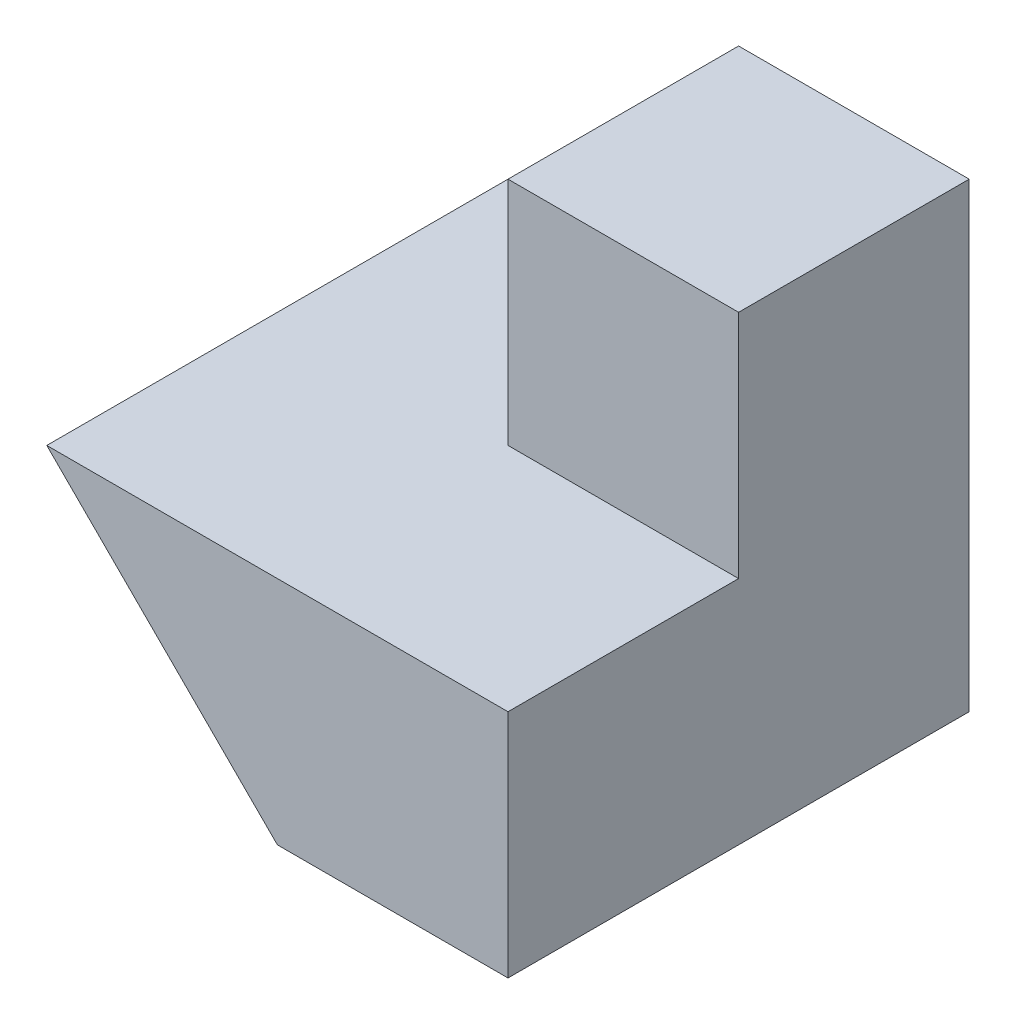
ISO-10303-21;
HEADER;
FILE_DESCRIPTION(('STEP AP214'),'2;1');
FILE_NAME('part.step','',(''),(''),'','','');
FILE_SCHEMA(('AUTOMOTIVE_DESIGN { 1 0 10303 214 1 1 1 1 }'));
ENDSEC;
DATA;
#1=APPLICATION_CONTEXT('core data for automotive mechanical design processes');
#2=APPLICATION_PROTOCOL_DEFINITION('international standard','automotive_design',2000,#1);
#3=PRODUCT_CONTEXT('',#1,'mechanical');
#4=PRODUCT('Part','Part','',(#3));
#5=PRODUCT_RELATED_PRODUCT_CATEGORY('part','',(#4));
#6=PRODUCT_DEFINITION_FORMATION('','',#4);
#7=PRODUCT_DEFINITION_CONTEXT('part definition',#1,'design');
#8=PRODUCT_DEFINITION('design','',#6,#7);
#9=PRODUCT_DEFINITION_SHAPE('','',#8);
#10=(LENGTH_UNIT() NAMED_UNIT(*) SI_UNIT(.MILLI.,.METRE.));
#11=(NAMED_UNIT(*) PLANE_ANGLE_UNIT() SI_UNIT($,.RADIAN.));
#12=(NAMED_UNIT(*) SI_UNIT($,.STERADIAN.) SOLID_ANGLE_UNIT());
#13=UNCERTAINTY_MEASURE_WITH_UNIT(LENGTH_MEASURE(1.E-05),#10,'distance_accuracy_value','');
#14=(GEOMETRIC_REPRESENTATION_CONTEXT(3) GLOBAL_UNCERTAINTY_ASSIGNED_CONTEXT((#13)) GLOBAL_UNIT_ASSIGNED_CONTEXT((#10,
#11,#12)) REPRESENTATION_CONTEXT('',''));
#15=CARTESIAN_POINT('',(0.,0.,0.));
#16=DIRECTION('',(0.,0.,1.));
#17=DIRECTION('',(1.,0.,0.));
#18=AXIS2_PLACEMENT_3D('',#15,#16,#17);
#19=CARTESIAN_POINT('',(0.,0.,40.));
#20=DIRECTION('',(1.,0.,0.));
#21=DIRECTION('',(0.,0.,-1.));
#22=AXIS2_PLACEMENT_3D('',#19,#20,#21);
#23=PLANE('',#22);
#24=DIRECTION('',(0.,-1.,0.));
#25=VECTOR('',#24,1.);
#26=CARTESIAN_POINT('',(0.,0.,20.));
#27=LINE('',#26,#25);
#28=CARTESIAN_POINT('',(0.,20.,20.));
#29=VERTEX_POINT('',#28);
#30=CARTESIAN_POINT('',(0.,0.,20.));
#31=VERTEX_POINT('',#30);
#32=EDGE_CURVE('E101',#29,#31,#27,.T.);
#33=ORIENTED_EDGE('',*,*,#32,.F.);
#34=DIRECTION('',(0.,0.,1.));
#35=VECTOR('',#34,1.);
#36=CARTESIAN_POINT('',(0.,20.,0.));
#37=LINE('',#36,#35);
#38=CARTESIAN_POINT('',(0.,20.,0.));
#39=VERTEX_POINT('',#38);
#40=EDGE_CURVE('E123',#39,#29,#37,.T.);
#41=ORIENTED_EDGE('',*,*,#40,.F.);
#42=DIRECTION('',(0.,-1.,0.));
#43=VECTOR('',#42,1.);
#44=CARTESIAN_POINT('',(0.,0.,0.));
#45=LINE('',#44,#43);
#46=CARTESIAN_POINT('',(0.,0.,0.));
#47=VERTEX_POINT('',#46);
#48=EDGE_CURVE('E121',#39,#47,#45,.T.);
#49=ORIENTED_EDGE('',*,*,#48,.T.);
#50=DIRECTION('',(0.,0.,-1.));
#51=VECTOR('',#50,1.);
#52=CARTESIAN_POINT('',(0.,0.,40.));
#53=LINE('',#52,#51);
#54=EDGE_CURVE('E11',#31,#47,#53,.T.);
#55=ORIENTED_EDGE('',*,*,#54,.F.);
#56=EDGE_LOOP('',(#33,#41,#49,#55));
#57=FACE_BOUND('',#56,.T.);
#58=ADVANCED_FACE('F33',(#57),#23,.F.);
#59=CARTESIAN_POINT('',(0.,0.,40.));
#60=DIRECTION('',(0.,1.,0.));
#61=DIRECTION('',(0.,0.,1.));
#62=AXIS2_PLACEMENT_3D('',#59,#60,#61);
#63=PLANE('',#62);
#64=DIRECTION('',(1.,0.,0.));
#65=VECTOR('',#64,1.);
#66=CARTESIAN_POINT('',(0.,0.,40.));
#67=LINE('',#66,#65);
#68=CARTESIAN_POINT('',(20.,0.,40.));
#69=VERTEX_POINT('',#68);
#70=CARTESIAN_POINT('',(40.,0.,40.));
#71=VERTEX_POINT('',#70);
#72=EDGE_CURVE('E143',#69,#71,#67,.T.);
#73=ORIENTED_EDGE('',*,*,#72,.F.);
#74=DIRECTION('',(0.,0.,1.));
#75=VECTOR('',#74,1.);
#76=CARTESIAN_POINT('',(20.,0.,20.));
#77=LINE('',#76,#75);
#78=CARTESIAN_POINT('',(20.,0.,20.));
#79=VERTEX_POINT('',#78);
#80=EDGE_CURVE('E118',#79,#69,#77,.T.);
#81=ORIENTED_EDGE('',*,*,#80,.F.);
#82=DIRECTION('',(1.,0.,0.));
#83=VECTOR('',#82,1.);
#84=CARTESIAN_POINT('',(20.,0.,20.));
#85=LINE('',#84,#83);
#86=EDGE_CURVE('E104',#31,#79,#85,.T.);
#87=ORIENTED_EDGE('',*,*,#86,.F.);
#88=ORIENTED_EDGE('',*,*,#54,.T.);
#89=DIRECTION('',(1.,0.,0.));
#90=VECTOR('',#89,1.);
#91=CARTESIAN_POINT('',(0.,0.,0.));
#92=LINE('',#91,#90);
#93=CARTESIAN_POINT('',(40.,0.,0.));
#94=VERTEX_POINT('',#93);
#95=EDGE_CURVE('E126',#47,#94,#92,.T.);
#96=ORIENTED_EDGE('',*,*,#95,.T.);
#97=DIRECTION('',(0.,0.,-1.));
#98=VECTOR('',#97,1.);
#99=CARTESIAN_POINT('',(40.,0.,40.));
#100=LINE('',#99,#98);
#101=EDGE_CURVE('E40',#71,#94,#100,.T.);
#102=ORIENTED_EDGE('',*,*,#101,.F.);
#103=EDGE_LOOP('',(#73,#81,#87,#88,#96,#102));
#104=FACE_BOUND('',#103,.T.);
#105=ADVANCED_FACE('F116',(#104),#63,.F.);
#106=CARTESIAN_POINT('',(40.,0.,40.));
#107=DIRECTION('',(-1.,0.,0.));
#108=DIRECTION('',(0.,0.,1.));
#109=AXIS2_PLACEMENT_3D('',#106,#107,#108);
#110=PLANE('',#109);
#111=DIRECTION('',(0.,-1.,0.));
#112=VECTOR('',#111,1.);
#113=CARTESIAN_POINT('',(40.,0.,20.));
#114=LINE('',#113,#112);
#115=CARTESIAN_POINT('',(40.,40.,20.));
#116=VERTEX_POINT('',#115);
#117=CARTESIAN_POINT('',(40.,20.,20.));
#118=VERTEX_POINT('',#117);
#119=EDGE_CURVE('E169',#116,#118,#114,.T.);
#120=ORIENTED_EDGE('',*,*,#119,.T.);
#121=DIRECTION('',(0.,0.,1.));
#122=VECTOR('',#121,1.);
#123=CARTESIAN_POINT('',(40.,20.,40.));
#124=LINE('',#123,#122);
#125=CARTESIAN_POINT('',(40.,20.,40.));
#126=VERTEX_POINT('',#125);
#127=EDGE_CURVE('E165',#118,#126,#124,.T.);
#128=ORIENTED_EDGE('',*,*,#127,.T.);
#129=DIRECTION('',(0.,1.,0.));
#130=VECTOR('',#129,1.);
#131=CARTESIAN_POINT('',(40.,0.,40.));
#132=LINE('',#131,#130);
#133=EDGE_CURVE('E145',#71,#126,#132,.T.);
#134=ORIENTED_EDGE('',*,*,#133,.F.);
#135=ORIENTED_EDGE('',*,*,#101,.T.);
#136=DIRECTION('',(0.,1.,0.));
#137=VECTOR('',#136,1.);
#138=CARTESIAN_POINT('',(40.,0.,0.));
#139=LINE('',#138,#137);
#140=CARTESIAN_POINT('',(40.,40.,0.));
#141=VERTEX_POINT('',#140);
#142=EDGE_CURVE('E133',#94,#141,#139,.T.);
#143=ORIENTED_EDGE('',*,*,#142,.T.);
#144=DIRECTION('',(0.,0.,-1.));
#145=VECTOR('',#144,1.);
#146=CARTESIAN_POINT('',(40.,40.,40.));
#147=LINE('',#146,#145);
#148=EDGE_CURVE('E144',#116,#141,#147,.T.);
#149=ORIENTED_EDGE('',*,*,#148,.F.);
#150=EDGE_LOOP('',(#120,#128,#134,#135,#143,#149));
#151=FACE_BOUND('',#150,.T.);
#152=ADVANCED_FACE('F149',(#151),#110,.F.);
#153=CARTESIAN_POINT('',(0.,40.,40.));
#154=DIRECTION('',(0.,-1.,0.));
#155=DIRECTION('',(0.,0.,-1.));
#156=AXIS2_PLACEMENT_3D('',#153,#154,#155);
#157=PLANE('',#156);
#158=DIRECTION('',(0.,0.,1.));
#159=VECTOR('',#158,1.);
#160=CARTESIAN_POINT('',(20.,40.,0.));
#161=LINE('',#160,#159);
#162=CARTESIAN_POINT('',(20.,40.,0.));
#163=VERTEX_POINT('',#162);
#164=CARTESIAN_POINT('',(20.,40.,20.));
#165=VERTEX_POINT('',#164);
#166=EDGE_CURVE('E127',#163,#165,#161,.T.);
#167=ORIENTED_EDGE('',*,*,#166,.T.);
#168=DIRECTION('',(-1.,0.,0.));
#169=VECTOR('',#168,1.);
#170=CARTESIAN_POINT('',(60.,40.,20.));
#171=LINE('',#170,#169);
#172=EDGE_CURVE('E172',#116,#165,#171,.T.);
#173=ORIENTED_EDGE('',*,*,#172,.F.);
#174=ORIENTED_EDGE('',*,*,#148,.T.);
#175=DIRECTION('',(-1.,0.,0.));
#176=VECTOR('',#175,1.);
#177=CARTESIAN_POINT('',(0.,40.,0.));
#178=LINE('',#177,#176);
#179=EDGE_CURVE('E137',#141,#163,#178,.T.);
#180=ORIENTED_EDGE('',*,*,#179,.T.);
#181=EDGE_LOOP('',(#167,#173,#174,#180));
#182=FACE_BOUND('',#181,.T.);
#183=ADVANCED_FACE('F188',(#182),#157,.F.);
#184=CARTESIAN_POINT('',(0.,0.,40.));
#185=DIRECTION('',(0.,0.,-1.));
#186=DIRECTION('',(-1.,0.,0.));
#187=AXIS2_PLACEMENT_3D('',#184,#185,#186);
#188=PLANE('',#187);
#189=DIRECTION('',(1.,0.,0.));
#190=VECTOR('',#189,1.);
#191=CARTESIAN_POINT('',(0.,20.,40.));
#192=LINE('',#191,#190);
#193=CARTESIAN_POINT('',(0.,20.,40.));
#194=VERTEX_POINT('',#193);
#195=EDGE_CURVE('E162',#194,#126,#192,.T.);
#196=ORIENTED_EDGE('',*,*,#195,.F.);
#197=DIRECTION('',(-0.707106781186547,0.707106781186548,0.));
#198=VECTOR('',#197,1.);
#199=CARTESIAN_POINT('',(0.,20.,40.));
#200=LINE('',#199,#198);
#201=EDGE_CURVE('E111',#69,#194,#200,.T.);
#202=ORIENTED_EDGE('',*,*,#201,.F.);
#203=ORIENTED_EDGE('',*,*,#72,.T.);
#204=ORIENTED_EDGE('',*,*,#133,.T.);
#205=EDGE_LOOP('',(#196,#202,#203,#204));
#206=FACE_BOUND('',#205,.T.);
#207=ADVANCED_FACE('F186',(#206),#188,.F.);
#208=CARTESIAN_POINT('',(0.,0.,0.));
#209=DIRECTION('',(0.,0.,-1.));
#210=DIRECTION('',(-1.,0.,0.));
#211=AXIS2_PLACEMENT_3D('',#208,#209,#210);
#212=PLANE('',#211);
#213=DIRECTION('',(0.,1.,0.));
#214=VECTOR('',#213,1.);
#215=CARTESIAN_POINT('',(20.,40.,0.));
#216=LINE('',#215,#214);
#217=CARTESIAN_POINT('',(20.,20.,0.));
#218=VERTEX_POINT('',#217);
#219=EDGE_CURVE('E55',#218,#163,#216,.T.);
#220=ORIENTED_EDGE('',*,*,#219,.T.);
#221=ORIENTED_EDGE('',*,*,#179,.F.);
#222=ORIENTED_EDGE('',*,*,#142,.F.);
#223=ORIENTED_EDGE('',*,*,#95,.F.);
#224=ORIENTED_EDGE('',*,*,#48,.F.);
#225=DIRECTION('',(1.,0.,0.));
#226=VECTOR('',#225,1.);
#227=CARTESIAN_POINT('',(0.,20.,0.));
#228=LINE('',#227,#226);
#229=EDGE_CURVE('E164',#39,#218,#228,.T.);
#230=ORIENTED_EDGE('',*,*,#229,.T.);
#231=EDGE_LOOP('',(#220,#221,#222,#223,#224,#230));
#232=FACE_BOUND('',#231,.T.);
#233=ADVANCED_FACE('F130',(#232),#212,.T.);
#234=CARTESIAN_POINT('',(20.,40.,0.));
#235=DIRECTION('',(1.,0.,0.));
#236=DIRECTION('',(0.,0.,-1.));
#237=AXIS2_PLACEMENT_3D('',#234,#235,#236);
#238=PLANE('',#237);
#239=DIRECTION('',(0.,0.,1.));
#240=VECTOR('',#239,1.);
#241=CARTESIAN_POINT('',(20.,20.,0.));
#242=LINE('',#241,#240);
#243=CARTESIAN_POINT('',(20.,20.,20.));
#244=VERTEX_POINT('',#243);
#245=EDGE_CURVE('E158',#218,#244,#242,.T.);
#246=ORIENTED_EDGE('',*,*,#245,.T.);
#247=DIRECTION('',(0.,-1.,0.));
#248=VECTOR('',#247,1.);
#249=CARTESIAN_POINT('',(20.,40.,20.));
#250=LINE('',#249,#248);
#251=EDGE_CURVE('E47',#165,#244,#250,.T.);
#252=ORIENTED_EDGE('',*,*,#251,.F.);
#253=ORIENTED_EDGE('',*,*,#166,.F.);
#254=ORIENTED_EDGE('',*,*,#219,.F.);
#255=EDGE_LOOP('',(#246,#252,#253,#254));
#256=FACE_BOUND('',#255,.T.);
#257=ADVANCED_FACE('F194',(#256),#238,.F.);
#258=CARTESIAN_POINT('',(0.,20.,0.));
#259=DIRECTION('',(0.,-1.,0.));
#260=DIRECTION('',(0.,0.,-1.));
#261=AXIS2_PLACEMENT_3D('',#258,#259,#260);
#262=PLANE('',#261);
#263=ORIENTED_EDGE('',*,*,#195,.T.);
#264=ORIENTED_EDGE('',*,*,#127,.F.);
#265=DIRECTION('',(-1.,0.,0.));
#266=VECTOR('',#265,1.);
#267=CARTESIAN_POINT('',(60.,20.,20.));
#268=LINE('',#267,#266);
#269=EDGE_CURVE('E171',#118,#244,#268,.T.);
#270=ORIENTED_EDGE('',*,*,#269,.T.);
#271=ORIENTED_EDGE('',*,*,#245,.F.);
#272=ORIENTED_EDGE('',*,*,#229,.F.);
#273=ORIENTED_EDGE('',*,*,#40,.T.);
#274=DIRECTION('',(0.,0.,1.));
#275=VECTOR('',#274,1.);
#276=CARTESIAN_POINT('',(0.,20.,20.));
#277=LINE('',#276,#275);
#278=EDGE_CURVE('E176',#29,#194,#277,.T.);
#279=ORIENTED_EDGE('',*,*,#278,.T.);
#280=EDGE_LOOP('',(#263,#264,#270,#271,#272,#273,#279));
#281=FACE_BOUND('',#280,.T.);
#282=ADVANCED_FACE('F185',(#281),#262,.F.);
#283=CARTESIAN_POINT('',(60.,40.,20.));
#284=DIRECTION('',(0.,0.,-1.));
#285=DIRECTION('',(-1.,0.,0.));
#286=AXIS2_PLACEMENT_3D('',#283,#284,#285);
#287=PLANE('',#286);
#288=ORIENTED_EDGE('',*,*,#172,.T.);
#289=ORIENTED_EDGE('',*,*,#251,.T.);
#290=ORIENTED_EDGE('',*,*,#269,.F.);
#291=ORIENTED_EDGE('',*,*,#119,.F.);
#292=EDGE_LOOP('',(#288,#289,#290,#291));
#293=FACE_BOUND('',#292,.T.);
#294=ADVANCED_FACE('F231',(#293),#287,.F.);
#295=CARTESIAN_POINT('',(0.,20.,20.));
#296=DIRECTION('',(0.707106781186548,0.707106781186547,0.));
#297=DIRECTION('',(-0.707106781186547,0.707106781186548,0.));
#298=AXIS2_PLACEMENT_3D('',#295,#296,#297);
#299=PLANE('',#298);
#300=ORIENTED_EDGE('',*,*,#201,.T.);
#301=ORIENTED_EDGE('',*,*,#278,.F.);
#302=DIRECTION('',(-0.707106781186547,0.707106781186548,0.));
#303=VECTOR('',#302,1.);
#304=CARTESIAN_POINT('',(0.,20.,20.));
#305=LINE('',#304,#303);
#306=EDGE_CURVE('E106',#79,#29,#305,.T.);
#307=ORIENTED_EDGE('',*,*,#306,.F.);
#308=ORIENTED_EDGE('',*,*,#80,.T.);
#309=EDGE_LOOP('',(#300,#301,#307,#308));
#310=FACE_BOUND('',#309,.T.);
#311=ADVANCED_FACE('F182',(#310),#299,.F.);
#312=CARTESIAN_POINT('',(0.,0.,20.));
#313=DIRECTION('',(0.,0.,1.));
#314=DIRECTION('',(1.,0.,0.));
#315=AXIS2_PLACEMENT_3D('',#312,#313,#314);
#316=PLANE('',#315);
#317=ORIENTED_EDGE('',*,*,#32,.T.);
#318=ORIENTED_EDGE('',*,*,#86,.T.);
#319=ORIENTED_EDGE('',*,*,#306,.T.);
#320=EDGE_LOOP('',(#317,#318,#319));
#321=FACE_BOUND('',#320,.T.);
#322=ADVANCED_FACE('F103',(#321),#316,.T.);
#323=CLOSED_SHELL('',(#58,#105,#152,#183,#207,#233,#257,#282,#294,#311,#322));
#324=MANIFOLD_SOLID_BREP('B2',#323);
#325=ADVANCED_BREP_SHAPE_REPRESENTATION('',(#18,#324),#14);
#326=SHAPE_DEFINITION_REPRESENTATION(#9,#325);
ENDSEC;
END-ISO-10303-21;
